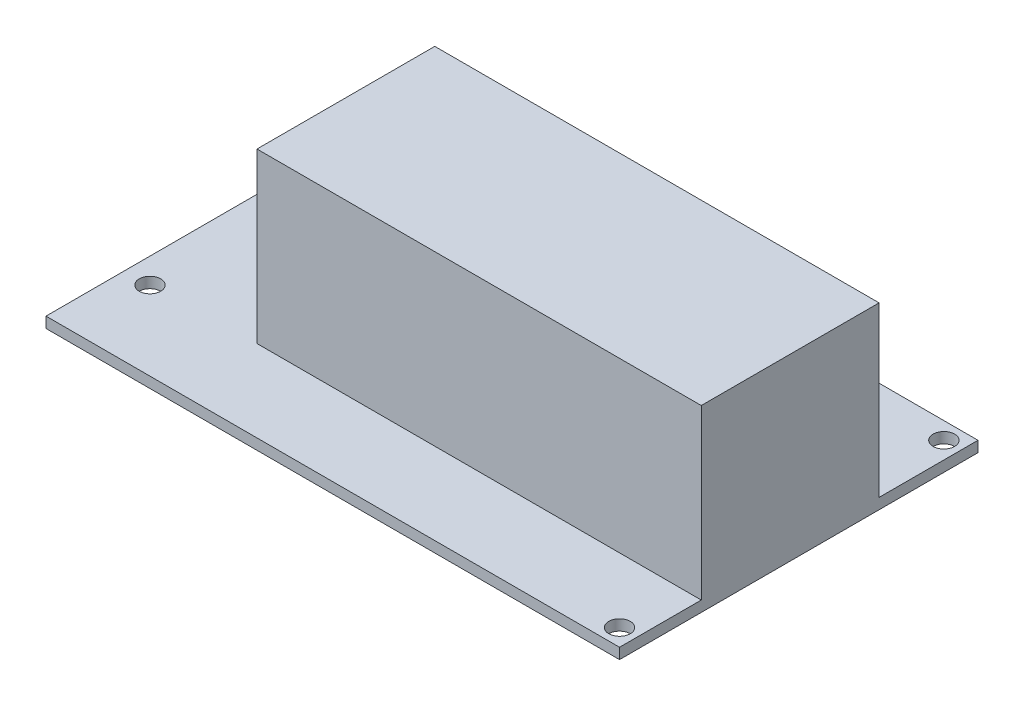
ISO-10303-21;
HEADER;
FILE_DESCRIPTION(('STEP AP214'),'2;1');
FILE_NAME('part.step','',(''),(''),'','','');
FILE_SCHEMA(('AUTOMOTIVE_DESIGN { 1 0 10303 214 1 1 1 1 }'));
ENDSEC;
DATA;
#1=APPLICATION_CONTEXT('core data for automotive mechanical design processes');
#2=APPLICATION_PROTOCOL_DEFINITION('international standard','automotive_design',2000,#1);
#3=PRODUCT_CONTEXT('',#1,'mechanical');
#4=PRODUCT('Part','Part','',(#3));
#5=PRODUCT_RELATED_PRODUCT_CATEGORY('part','',(#4));
#6=PRODUCT_DEFINITION_FORMATION('','',#4);
#7=PRODUCT_DEFINITION_CONTEXT('part definition',#1,'design');
#8=PRODUCT_DEFINITION('design','',#6,#7);
#9=PRODUCT_DEFINITION_SHAPE('','',#8);
#10=(LENGTH_UNIT() NAMED_UNIT(*) SI_UNIT(.MILLI.,.METRE.));
#11=(NAMED_UNIT(*) PLANE_ANGLE_UNIT() SI_UNIT($,.RADIAN.));
#12=(NAMED_UNIT(*) SI_UNIT($,.STERADIAN.) SOLID_ANGLE_UNIT());
#13=UNCERTAINTY_MEASURE_WITH_UNIT(LENGTH_MEASURE(1.E-05),#10,'distance_accuracy_value','');
#14=(GEOMETRIC_REPRESENTATION_CONTEXT(3) GLOBAL_UNCERTAINTY_ASSIGNED_CONTEXT((#13)) GLOBAL_UNIT_ASSIGNED_CONTEXT((#10,
#11,#12)) REPRESENTATION_CONTEXT('',''));
#15=CARTESIAN_POINT('',(0.,0.,0.));
#16=DIRECTION('',(0.,0.,1.));
#17=DIRECTION('',(1.,0.,0.));
#18=AXIS2_PLACEMENT_3D('',#15,#16,#17);
#19=CARTESIAN_POINT('',(0.,1.5,0.));
#20=DIRECTION('',(0.,0.,-1.));
#21=DIRECTION('',(-1.,0.,0.));
#22=AXIS2_PLACEMENT_3D('',#19,#20,#21);
#23=PLANE('',#22);
#24=DIRECTION('',(1.,0.,0.));
#25=VECTOR('',#24,1.);
#26=CARTESIAN_POINT('',(0.,0.,0.));
#27=LINE('',#26,#25);
#28=CARTESIAN_POINT('',(0.,0.,0.));
#29=VERTEX_POINT('',#28);
#30=CARTESIAN_POINT('',(80.,0.,0.));
#31=VERTEX_POINT('',#30);
#32=EDGE_CURVE('E121',#29,#31,#27,.T.);
#33=ORIENTED_EDGE('',*,*,#32,.F.);
#34=DIRECTION('',(0.,-1.,0.));
#35=VECTOR('',#34,1.);
#36=CARTESIAN_POINT('',(0.,1.5,0.));
#37=LINE('',#36,#35);
#38=CARTESIAN_POINT('',(0.,1.5,0.));
#39=VERTEX_POINT('',#38);
#40=EDGE_CURVE('E45',#39,#29,#37,.T.);
#41=ORIENTED_EDGE('',*,*,#40,.F.);
#42=DIRECTION('',(1.,0.,0.));
#43=VECTOR('',#42,1.);
#44=CARTESIAN_POINT('',(0.,1.5,0.));
#45=LINE('',#44,#43);
#46=CARTESIAN_POINT('',(80.,1.5,0.));
#47=VERTEX_POINT('',#46);
#48=EDGE_CURVE('E110',#39,#47,#45,.T.);
#49=ORIENTED_EDGE('',*,*,#48,.T.);
#50=DIRECTION('',(0.,-1.,0.));
#51=VECTOR('',#50,1.);
#52=CARTESIAN_POINT('',(80.,1.5,0.));
#53=LINE('',#52,#51);
#54=EDGE_CURVE('E11',#47,#31,#53,.T.);
#55=ORIENTED_EDGE('',*,*,#54,.T.);
#56=EDGE_LOOP('',(#33,#41,#49,#55));
#57=FACE_BOUND('',#56,.T.);
#58=ADVANCED_FACE('F36',(#57),#23,.T.);
#59=CARTESIAN_POINT('',(0.,1.5,0.));
#60=DIRECTION('',(1.,0.,0.));
#61=DIRECTION('',(0.,0.,-1.));
#62=AXIS2_PLACEMENT_3D('',#59,#60,#61);
#63=PLANE('',#62);
#64=DIRECTION('',(0.,0.,1.));
#65=VECTOR('',#64,1.);
#66=CARTESIAN_POINT('',(0.,0.,0.));
#67=LINE('',#66,#65);
#68=CARTESIAN_POINT('',(0.,0.,50.));
#69=VERTEX_POINT('',#68);
#70=EDGE_CURVE('E114',#29,#69,#67,.T.);
#71=ORIENTED_EDGE('',*,*,#70,.T.);
#72=DIRECTION('',(0.,-1.,0.));
#73=VECTOR('',#72,1.);
#74=CARTESIAN_POINT('',(0.,1.5,50.));
#75=LINE('',#74,#73);
#76=CARTESIAN_POINT('',(0.,1.5,50.));
#77=VERTEX_POINT('',#76);
#78=EDGE_CURVE('E101',#77,#69,#75,.T.);
#79=ORIENTED_EDGE('',*,*,#78,.F.);
#80=DIRECTION('',(0.,0.,1.));
#81=VECTOR('',#80,1.);
#82=CARTESIAN_POINT('',(0.,1.5,0.));
#83=LINE('',#82,#81);
#84=EDGE_CURVE('E103',#39,#77,#83,.T.);
#85=ORIENTED_EDGE('',*,*,#84,.F.);
#86=ORIENTED_EDGE('',*,*,#40,.T.);
#87=EDGE_LOOP('',(#71,#79,#85,#86));
#88=FACE_BOUND('',#87,.T.);
#89=ADVANCED_FACE('F113',(#88),#63,.F.);
#90=CARTESIAN_POINT('',(0.,1.5,50.));
#91=DIRECTION('',(0.,0.,-1.));
#92=DIRECTION('',(-1.,0.,0.));
#93=AXIS2_PLACEMENT_3D('',#90,#91,#92);
#94=PLANE('',#93);
#95=DIRECTION('',(1.,0.,0.));
#96=VECTOR('',#95,1.);
#97=CARTESIAN_POINT('',(0.,0.,50.));
#98=LINE('',#97,#96);
#99=CARTESIAN_POINT('',(80.,0.,50.));
#100=VERTEX_POINT('',#99);
#101=EDGE_CURVE('E71',#69,#100,#98,.T.);
#102=ORIENTED_EDGE('',*,*,#101,.T.);
#103=DIRECTION('',(0.,-1.,0.));
#104=VECTOR('',#103,1.);
#105=CARTESIAN_POINT('',(80.,1.5,50.));
#106=LINE('',#105,#104);
#107=CARTESIAN_POINT('',(80.,1.5,50.));
#108=VERTEX_POINT('',#107);
#109=EDGE_CURVE('E77',#108,#100,#106,.T.);
#110=ORIENTED_EDGE('',*,*,#109,.F.);
#111=DIRECTION('',(1.,0.,0.));
#112=VECTOR('',#111,1.);
#113=CARTESIAN_POINT('',(0.,1.5,50.));
#114=LINE('',#113,#112);
#115=EDGE_CURVE('E97',#77,#108,#114,.T.);
#116=ORIENTED_EDGE('',*,*,#115,.F.);
#117=ORIENTED_EDGE('',*,*,#78,.T.);
#118=EDGE_LOOP('',(#102,#110,#116,#117));
#119=FACE_BOUND('',#118,.T.);
#120=ADVANCED_FACE('F99',(#119),#94,.F.);
#121=CARTESIAN_POINT('',(3.5,1.5,11.));
#122=DIRECTION('',(0.,-1.,0.));
#123=DIRECTION('',(0.,0.,-1.));
#124=AXIS2_PLACEMENT_3D('',#121,#122,#123);
#125=CYLINDRICAL_SURFACE('',#124,1.5);
#126=CARTESIAN_POINT('',(3.5,1.5,11.));
#127=DIRECTION('',(0.,1.,0.));
#128=DIRECTION('',(0.,0.,1.));
#129=AXIS2_PLACEMENT_3D('',#126,#127,#128);
#130=CIRCLE('',#129,1.5);
#131=CARTESIAN_POINT('',(3.5,1.5,12.5));
#132=VERTEX_POINT('',#131);
#133=EDGE_CURVE('E148',#132,#132,#130,.T.);
#134=ORIENTED_EDGE('',*,*,#133,.T.);
#135=EDGE_LOOP('',(#134));
#136=FACE_BOUND('',#135,.T.);
#137=CARTESIAN_POINT('',(3.5,0.,11.));
#138=DIRECTION('',(0.,1.,0.));
#139=DIRECTION('',(0.,0.,1.));
#140=AXIS2_PLACEMENT_3D('',#137,#138,#139);
#141=CIRCLE('',#140,1.5);
#142=CARTESIAN_POINT('',(3.5,0.,12.5));
#143=VERTEX_POINT('',#142);
#144=EDGE_CURVE('E124',#143,#143,#141,.T.);
#145=ORIENTED_EDGE('',*,*,#144,.F.);
#146=EDGE_LOOP('',(#145));
#147=FACE_BOUND('',#146,.T.);
#148=ADVANCED_FACE('F218',(#136,#147),#125,.F.);
#149=CARTESIAN_POINT('',(3.5,1.5,39.));
#150=DIRECTION('',(0.,-1.,0.));
#151=DIRECTION('',(0.,0.,-1.));
#152=AXIS2_PLACEMENT_3D('',#149,#150,#151);
#153=CYLINDRICAL_SURFACE('',#152,1.5);
#154=CARTESIAN_POINT('',(3.5,1.5,39.));
#155=DIRECTION('',(0.,1.,0.));
#156=DIRECTION('',(0.,0.,1.));
#157=AXIS2_PLACEMENT_3D('',#154,#155,#156);
#158=CIRCLE('',#157,1.5);
#159=CARTESIAN_POINT('',(3.5,1.5,40.5));
#160=VERTEX_POINT('',#159);
#161=EDGE_CURVE('E151',#160,#160,#158,.T.);
#162=ORIENTED_EDGE('',*,*,#161,.T.);
#163=EDGE_LOOP('',(#162));
#164=FACE_BOUND('',#163,.T.);
#165=CARTESIAN_POINT('',(3.5,0.,39.));
#166=DIRECTION('',(0.,1.,0.));
#167=DIRECTION('',(0.,0.,1.));
#168=AXIS2_PLACEMENT_3D('',#165,#166,#167);
#169=CIRCLE('',#168,1.5);
#170=CARTESIAN_POINT('',(3.5,0.,40.5));
#171=VERTEX_POINT('',#170);
#172=EDGE_CURVE('E129',#171,#171,#169,.T.);
#173=ORIENTED_EDGE('',*,*,#172,.F.);
#174=EDGE_LOOP('',(#173));
#175=FACE_BOUND('',#174,.T.);
#176=ADVANCED_FACE('F220',(#164,#175),#153,.F.);
#177=CARTESIAN_POINT('',(77.62,1.5,47.62));
#178=DIRECTION('',(0.,-1.,0.));
#179=DIRECTION('',(0.,0.,-1.));
#180=AXIS2_PLACEMENT_3D('',#177,#178,#179);
#181=CYLINDRICAL_SURFACE('',#180,1.5);
#182=CARTESIAN_POINT('',(77.62,1.5,47.62));
#183=DIRECTION('',(0.,1.,0.));
#184=DIRECTION('',(0.,0.,1.));
#185=AXIS2_PLACEMENT_3D('',#182,#183,#184);
#186=CIRCLE('',#185,1.5);
#187=CARTESIAN_POINT('',(77.62,1.5,49.12));
#188=VERTEX_POINT('',#187);
#189=EDGE_CURVE('E154',#188,#188,#186,.T.);
#190=ORIENTED_EDGE('',*,*,#189,.T.);
#191=EDGE_LOOP('',(#190));
#192=FACE_BOUND('',#191,.T.);
#193=CARTESIAN_POINT('',(77.62,0.,47.62));
#194=DIRECTION('',(0.,1.,0.));
#195=DIRECTION('',(0.,0.,1.));
#196=AXIS2_PLACEMENT_3D('',#193,#194,#195);
#197=CIRCLE('',#196,1.5);
#198=CARTESIAN_POINT('',(77.62,0.,49.12));
#199=VERTEX_POINT('',#198);
#200=EDGE_CURVE('E132',#199,#199,#197,.T.);
#201=ORIENTED_EDGE('',*,*,#200,.F.);
#202=EDGE_LOOP('',(#201));
#203=FACE_BOUND('',#202,.T.);
#204=ADVANCED_FACE('F227',(#192,#203),#181,.F.);
#205=CARTESIAN_POINT('',(77.62,1.5,2.38));
#206=DIRECTION('',(0.,-1.,0.));
#207=DIRECTION('',(0.,0.,-1.));
#208=AXIS2_PLACEMENT_3D('',#205,#206,#207);
#209=CYLINDRICAL_SURFACE('',#208,1.5);
#210=CARTESIAN_POINT('',(77.62,1.5,2.38));
#211=DIRECTION('',(0.,1.,0.));
#212=DIRECTION('',(0.,0.,1.));
#213=AXIS2_PLACEMENT_3D('',#210,#211,#212);
#214=CIRCLE('',#213,1.5);
#215=CARTESIAN_POINT('',(77.62,1.5,3.88));
#216=VERTEX_POINT('',#215);
#217=EDGE_CURVE('E126',#216,#216,#214,.T.);
#218=ORIENTED_EDGE('',*,*,#217,.T.);
#219=EDGE_LOOP('',(#218));
#220=FACE_BOUND('',#219,.T.);
#221=CARTESIAN_POINT('',(77.62,0.,2.38));
#222=DIRECTION('',(0.,1.,0.));
#223=DIRECTION('',(0.,0.,1.));
#224=AXIS2_PLACEMENT_3D('',#221,#222,#223);
#225=CIRCLE('',#224,1.5);
#226=CARTESIAN_POINT('',(77.62,0.,3.88));
#227=VERTEX_POINT('',#226);
#228=EDGE_CURVE('E135',#227,#227,#225,.T.);
#229=ORIENTED_EDGE('',*,*,#228,.F.);
#230=EDGE_LOOP('',(#229));
#231=FACE_BOUND('',#230,.T.);
#232=ADVANCED_FACE('F38',(#220,#231),#209,.F.);
#233=CARTESIAN_POINT('',(80.,1.5,0.));
#234=DIRECTION('',(1.,0.,0.));
#235=DIRECTION('',(0.,0.,-1.));
#236=AXIS2_PLACEMENT_3D('',#233,#234,#235);
#237=PLANE('',#236);
#238=DIRECTION('',(0.,0.,1.));
#239=VECTOR('',#238,1.);
#240=CARTESIAN_POINT('',(80.,0.,0.));
#241=LINE('',#240,#239);
#242=EDGE_CURVE('E119',#31,#100,#241,.T.);
#243=ORIENTED_EDGE('',*,*,#242,.F.);
#244=ORIENTED_EDGE('',*,*,#54,.F.);
#245=DIRECTION('',(0.,0.,1.));
#246=VECTOR('',#245,1.);
#247=CARTESIAN_POINT('',(80.,1.5,0.));
#248=LINE('',#247,#246);
#249=CARTESIAN_POINT('',(80.,1.5,13.8));
#250=VERTEX_POINT('',#249);
#251=EDGE_CURVE('E140',#47,#250,#248,.T.);
#252=ORIENTED_EDGE('',*,*,#251,.T.);
#253=DIRECTION('',(0.,-1.,0.));
#254=VECTOR('',#253,1.);
#255=CARTESIAN_POINT('',(80.,25.,13.8));
#256=LINE('',#255,#254);
#257=CARTESIAN_POINT('',(80.,25.,13.8));
#258=VERTEX_POINT('',#257);
#259=EDGE_CURVE('E164',#258,#250,#256,.T.);
#260=ORIENTED_EDGE('',*,*,#259,.F.);
#261=DIRECTION('',(0.,0.,1.));
#262=VECTOR('',#261,1.);
#263=CARTESIAN_POINT('',(80.,25.,0.));
#264=LINE('',#263,#262);
#265=CARTESIAN_POINT('',(80.,25.,38.6));
#266=VERTEX_POINT('',#265);
#267=EDGE_CURVE('E173',#258,#266,#264,.T.);
#268=ORIENTED_EDGE('',*,*,#267,.T.);
#269=DIRECTION('',(0.,-1.,0.));
#270=VECTOR('',#269,1.);
#271=CARTESIAN_POINT('',(80.,25.,38.6));
#272=LINE('',#271,#270);
#273=CARTESIAN_POINT('',(80.,1.5,38.6));
#274=VERTEX_POINT('',#273);
#275=EDGE_CURVE('E161',#266,#274,#272,.T.);
#276=ORIENTED_EDGE('',*,*,#275,.T.);
#277=EDGE_CURVE('E53',#274,#108,#248,.T.);
#278=ORIENTED_EDGE('',*,*,#277,.T.);
#279=ORIENTED_EDGE('',*,*,#109,.T.);
#280=EDGE_LOOP('',(#243,#244,#252,#260,#268,#276,#278,#279));
#281=FACE_BOUND('',#280,.T.);
#282=ADVANCED_FACE('F199',(#281),#237,.T.);
#283=CARTESIAN_POINT('',(0.,1.5,0.));
#284=DIRECTION('',(0.,1.,0.));
#285=DIRECTION('',(0.,0.,1.));
#286=AXIS2_PLACEMENT_3D('',#283,#284,#285);
#287=PLANE('',#286);
#288=ORIENTED_EDGE('',*,*,#217,.F.);
#289=EDGE_LOOP('',(#288));
#290=FACE_BOUND('',#289,.T.);
#291=ORIENTED_EDGE('',*,*,#189,.F.);
#292=EDGE_LOOP('',(#291));
#293=FACE_BOUND('',#292,.T.);
#294=ORIENTED_EDGE('',*,*,#161,.F.);
#295=EDGE_LOOP('',(#294));
#296=FACE_BOUND('',#295,.T.);
#297=ORIENTED_EDGE('',*,*,#133,.F.);
#298=EDGE_LOOP('',(#297));
#299=FACE_BOUND('',#298,.T.);
#300=DIRECTION('',(1.,0.,0.));
#301=VECTOR('',#300,1.);
#302=CARTESIAN_POINT('',(0.,1.5,38.6));
#303=LINE('',#302,#301);
#304=CARTESIAN_POINT('',(18.029374718185,1.5,38.6));
#305=VERTEX_POINT('',#304);
#306=EDGE_CURVE('E81',#305,#274,#303,.T.);
#307=ORIENTED_EDGE('',*,*,#306,.F.);
#308=DIRECTION('',(0.,0.,1.));
#309=VECTOR('',#308,1.);
#310=CARTESIAN_POINT('',(18.029374718185,1.5,0.));
#311=LINE('',#310,#309);
#312=CARTESIAN_POINT('',(18.029374718185,1.5,13.8));
#313=VERTEX_POINT('',#312);
#314=EDGE_CURVE('E145',#313,#305,#311,.T.);
#315=ORIENTED_EDGE('',*,*,#314,.F.);
#316=DIRECTION('',(1.,0.,0.));
#317=VECTOR('',#316,1.);
#318=CARTESIAN_POINT('',(0.,1.5,13.8));
#319=LINE('',#318,#317);
#320=EDGE_CURVE('E143',#313,#250,#319,.T.);
#321=ORIENTED_EDGE('',*,*,#320,.T.);
#322=ORIENTED_EDGE('',*,*,#251,.F.);
#323=ORIENTED_EDGE('',*,*,#48,.F.);
#324=ORIENTED_EDGE('',*,*,#84,.T.);
#325=ORIENTED_EDGE('',*,*,#115,.T.);
#326=ORIENTED_EDGE('',*,*,#277,.F.);
#327=EDGE_LOOP('',(#307,#315,#321,#322,#323,#324,#325,#326));
#328=FACE_BOUND('',#327,.T.);
#329=ADVANCED_FACE('F107',(#290,#293,#296,#299,#328),#287,.T.);
#330=CARTESIAN_POINT('',(0.,0.,0.));
#331=DIRECTION('',(0.,1.,0.));
#332=DIRECTION('',(0.,0.,1.));
#333=AXIS2_PLACEMENT_3D('',#330,#331,#332);
#334=PLANE('',#333);
#335=ORIENTED_EDGE('',*,*,#32,.T.);
#336=ORIENTED_EDGE('',*,*,#242,.T.);
#337=ORIENTED_EDGE('',*,*,#101,.F.);
#338=ORIENTED_EDGE('',*,*,#70,.F.);
#339=EDGE_LOOP('',(#335,#336,#337,#338));
#340=FACE_BOUND('',#339,.T.);
#341=ORIENTED_EDGE('',*,*,#228,.T.);
#342=EDGE_LOOP('',(#341));
#343=FACE_BOUND('',#342,.T.);
#344=ORIENTED_EDGE('',*,*,#200,.T.);
#345=EDGE_LOOP('',(#344));
#346=FACE_BOUND('',#345,.T.);
#347=ORIENTED_EDGE('',*,*,#172,.T.);
#348=EDGE_LOOP('',(#347));
#349=FACE_BOUND('',#348,.T.);
#350=ORIENTED_EDGE('',*,*,#144,.T.);
#351=EDGE_LOOP('',(#350));
#352=FACE_BOUND('',#351,.T.);
#353=ADVANCED_FACE('F206',(#340,#343,#346,#349,#352),#334,.F.);
#354=CARTESIAN_POINT('',(18.029374718185,25.,0.));
#355=DIRECTION('',(1.,0.,0.));
#356=DIRECTION('',(0.,0.,-1.));
#357=AXIS2_PLACEMENT_3D('',#354,#355,#356);
#358=PLANE('',#357);
#359=ORIENTED_EDGE('',*,*,#314,.T.);
#360=DIRECTION('',(0.,-1.,0.));
#361=VECTOR('',#360,1.);
#362=CARTESIAN_POINT('',(18.029374718185,25.,38.6));
#363=LINE('',#362,#361);
#364=CARTESIAN_POINT('',(18.029374718185,25.,38.6));
#365=VERTEX_POINT('',#364);
#366=EDGE_CURVE('E137',#365,#305,#363,.T.);
#367=ORIENTED_EDGE('',*,*,#366,.F.);
#368=DIRECTION('',(0.,0.,1.));
#369=VECTOR('',#368,1.);
#370=CARTESIAN_POINT('',(18.029374718185,25.,0.));
#371=LINE('',#370,#369);
#372=CARTESIAN_POINT('',(18.029374718185,25.,13.8));
#373=VERTEX_POINT('',#372);
#374=EDGE_CURVE('E179',#373,#365,#371,.T.);
#375=ORIENTED_EDGE('',*,*,#374,.F.);
#376=DIRECTION('',(0.,-1.,0.));
#377=VECTOR('',#376,1.);
#378=CARTESIAN_POINT('',(18.029374718185,25.,13.8));
#379=LINE('',#378,#377);
#380=EDGE_CURVE('E167',#373,#313,#379,.T.);
#381=ORIENTED_EDGE('',*,*,#380,.T.);
#382=EDGE_LOOP('',(#359,#367,#375,#381));
#383=FACE_BOUND('',#382,.T.);
#384=ADVANCED_FACE('F193',(#383),#358,.F.);
#385=CARTESIAN_POINT('',(0.,25.,38.6));
#386=DIRECTION('',(0.,0.,-1.));
#387=DIRECTION('',(-1.,0.,0.));
#388=AXIS2_PLACEMENT_3D('',#385,#386,#387);
#389=PLANE('',#388);
#390=ORIENTED_EDGE('',*,*,#306,.T.);
#391=ORIENTED_EDGE('',*,*,#275,.F.);
#392=DIRECTION('',(1.,0.,0.));
#393=VECTOR('',#392,1.);
#394=CARTESIAN_POINT('',(0.,25.,38.6));
#395=LINE('',#394,#393);
#396=EDGE_CURVE('E176',#365,#266,#395,.T.);
#397=ORIENTED_EDGE('',*,*,#396,.F.);
#398=ORIENTED_EDGE('',*,*,#366,.T.);
#399=EDGE_LOOP('',(#390,#391,#397,#398));
#400=FACE_BOUND('',#399,.T.);
#401=ADVANCED_FACE('F195',(#400),#389,.F.);
#402=CARTESIAN_POINT('',(0.,25.,13.8));
#403=DIRECTION('',(0.,0.,-1.));
#404=DIRECTION('',(-1.,0.,0.));
#405=AXIS2_PLACEMENT_3D('',#402,#403,#404);
#406=PLANE('',#405);
#407=ORIENTED_EDGE('',*,*,#259,.T.);
#408=ORIENTED_EDGE('',*,*,#320,.F.);
#409=ORIENTED_EDGE('',*,*,#380,.F.);
#410=DIRECTION('',(1.,0.,0.));
#411=VECTOR('',#410,1.);
#412=CARTESIAN_POINT('',(0.,25.,13.8));
#413=LINE('',#412,#411);
#414=EDGE_CURVE('E170',#373,#258,#413,.T.);
#415=ORIENTED_EDGE('',*,*,#414,.T.);
#416=EDGE_LOOP('',(#407,#408,#409,#415));
#417=FACE_BOUND('',#416,.T.);
#418=ADVANCED_FACE('F202',(#417),#406,.T.);
#419=CARTESIAN_POINT('',(0.,25.,0.));
#420=DIRECTION('',(0.,1.,0.));
#421=DIRECTION('',(0.,0.,1.));
#422=AXIS2_PLACEMENT_3D('',#419,#420,#421);
#423=PLANE('',#422);
#424=ORIENTED_EDGE('',*,*,#374,.T.);
#425=ORIENTED_EDGE('',*,*,#396,.T.);
#426=ORIENTED_EDGE('',*,*,#267,.F.);
#427=ORIENTED_EDGE('',*,*,#414,.F.);
#428=EDGE_LOOP('',(#424,#425,#426,#427));
#429=FACE_BOUND('',#428,.T.);
#430=ADVANCED_FACE('F186',(#429),#423,.T.);
#431=CLOSED_SHELL('',(#58,#89,#120,#148,#176,#204,#232,#282,#329,#353,#384,#401,#418,#430));
#432=MANIFOLD_SOLID_BREP('B2',#431);
#433=ADVANCED_BREP_SHAPE_REPRESENTATION('',(#18,#432),#14);
#434=SHAPE_DEFINITION_REPRESENTATION(#9,#433);
ENDSEC;
END-ISO-10303-21;
